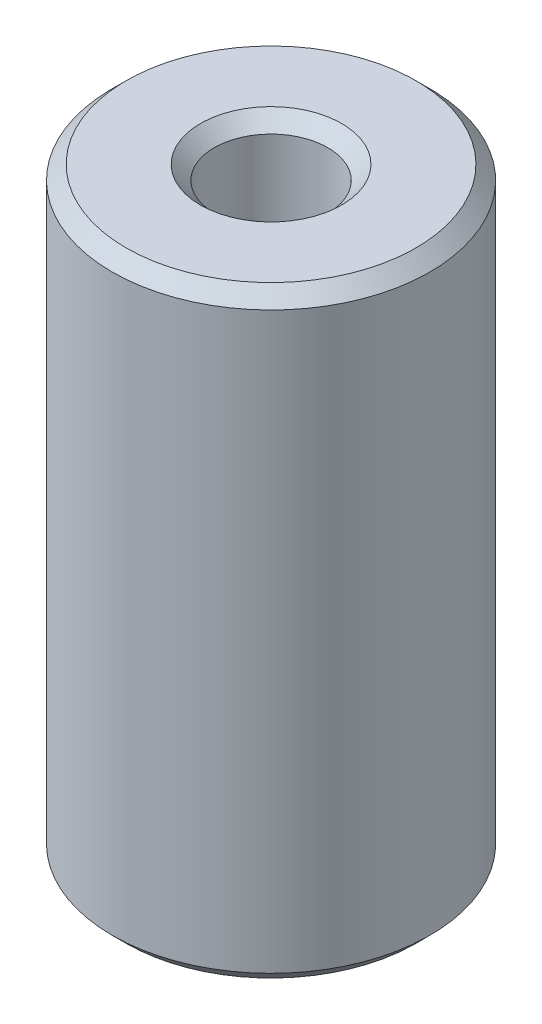
ISO-10303-21;
HEADER;
FILE_DESCRIPTION(('STEP AP214'),'2;1');
FILE_NAME('part.step','',(''),(''),'','','');
FILE_SCHEMA(('AUTOMOTIVE_DESIGN { 1 0 10303 214 1 1 1 1 }'));
ENDSEC;
DATA;
#1=APPLICATION_CONTEXT('core data for automotive mechanical design processes');
#2=APPLICATION_PROTOCOL_DEFINITION('international standard','automotive_design',2000,#1);
#3=PRODUCT_CONTEXT('',#1,'mechanical');
#4=PRODUCT('Part','Part','',(#3));
#5=PRODUCT_RELATED_PRODUCT_CATEGORY('part','',(#4));
#6=PRODUCT_DEFINITION_FORMATION('','',#4);
#7=PRODUCT_DEFINITION_CONTEXT('part definition',#1,'design');
#8=PRODUCT_DEFINITION('design','',#6,#7);
#9=PRODUCT_DEFINITION_SHAPE('','',#8);
#10=(LENGTH_UNIT() NAMED_UNIT(*) SI_UNIT(.MILLI.,.METRE.));
#11=(NAMED_UNIT(*) PLANE_ANGLE_UNIT() SI_UNIT($,.RADIAN.));
#12=(NAMED_UNIT(*) SI_UNIT($,.STERADIAN.) SOLID_ANGLE_UNIT());
#13=UNCERTAINTY_MEASURE_WITH_UNIT(LENGTH_MEASURE(1.E-05),#10,'distance_accuracy_value','');
#14=(GEOMETRIC_REPRESENTATION_CONTEXT(3) GLOBAL_UNCERTAINTY_ASSIGNED_CONTEXT((#13)) GLOBAL_UNIT_ASSIGNED_CONTEXT((#10,
#11,#12)) REPRESENTATION_CONTEXT('',''));
#15=CARTESIAN_POINT('',(0.,0.,0.));
#16=DIRECTION('',(0.,0.,1.));
#17=DIRECTION('',(1.,0.,0.));
#18=AXIS2_PLACEMENT_3D('',#15,#16,#17);
#19=CARTESIAN_POINT('',(0.,28.4437403289238,0.));
#20=DIRECTION('',(0.,-1.,0.));
#21=DIRECTION('',(0.,0.,-1.));
#22=AXIS2_PLACEMENT_3D('',#19,#20,#21);
#23=CYLINDRICAL_SURFACE('',#22,7.5);
#24=CARTESIAN_POINT('',(0.,0.657564701101291,0.));
#25=DIRECTION('',(0.,1.,0.));
#26=DIRECTION('',(0.,0.,1.));
#27=AXIS2_PLACEMENT_3D('',#24,#25,#26);
#28=CIRCLE('',#27,7.5);
#29=CARTESIAN_POINT('',(0.,0.657564701101291,7.5));
#30=VERTEX_POINT('',#29);
#31=EDGE_CURVE('E10',#30,#30,#28,.T.);
#32=ORIENTED_EDGE('',*,*,#31,.T.);
#33=EDGE_LOOP('',(#32));
#34=FACE_BOUND('',#33,.T.);
#35=CARTESIAN_POINT('',(0.,27.7861756278225,0.));
#36=DIRECTION('',(0.,1.,0.));
#37=DIRECTION('',(0.,0.,1.));
#38=AXIS2_PLACEMENT_3D('',#35,#36,#37);
#39=CIRCLE('',#38,7.5);
#40=CARTESIAN_POINT('',(0.,27.7861756278225,7.5));
#41=VERTEX_POINT('',#40);
#42=EDGE_CURVE('E50',#41,#41,#39,.F.);
#43=ORIENTED_EDGE('',*,*,#42,.T.);
#44=EDGE_LOOP('',(#43));
#45=FACE_BOUND('',#44,.T.);
#46=ADVANCED_FACE('F39',(#34,#45),#23,.T.);
#47=CARTESIAN_POINT('',(0.,28.4437403289238,0.));
#48=DIRECTION('',(0.,1.,0.));
#49=DIRECTION('',(0.,0.,1.));
#50=AXIS2_PLACEMENT_3D('',#47,#48,#49);
#51=PLANE('',#50);
#52=CARTESIAN_POINT('',(0.,28.4437403289238,0.));
#53=DIRECTION('',(0.,1.,0.));
#54=DIRECTION('',(0.,0.,1.));
#55=AXIS2_PLACEMENT_3D('',#52,#53,#54);
#56=CIRCLE('',#55,3.33714681555327);
#57=CARTESIAN_POINT('',(0.,28.4437403289238,3.33714681555327));
#58=VERTEX_POINT('',#57);
#59=EDGE_CURVE('E58',#58,#58,#56,.F.);
#60=ORIENTED_EDGE('',*,*,#59,.T.);
#61=EDGE_LOOP('',(#60));
#62=FACE_BOUND('',#61,.T.);
#63=CARTESIAN_POINT('',(0.,28.4437403289238,0.));
#64=DIRECTION('',(0.,1.,0.));
#65=DIRECTION('',(0.,0.,1.));
#66=AXIS2_PLACEMENT_3D('',#63,#64,#65);
#67=CIRCLE('',#66,6.8424352988987);
#68=CARTESIAN_POINT('',(0.,28.4437403289238,6.8424352988987));
#69=VERTEX_POINT('',#68);
#70=EDGE_CURVE('E61',#69,#69,#67,.T.);
#71=ORIENTED_EDGE('',*,*,#70,.T.);
#72=EDGE_LOOP('',(#71));
#73=FACE_BOUND('',#72,.T.);
#74=ADVANCED_FACE('F88',(#62,#73),#51,.T.);
#75=CARTESIAN_POINT('',(0.,0.,0.));
#76=DIRECTION('',(0.,1.,0.));
#77=DIRECTION('',(0.,0.,1.));
#78=AXIS2_PLACEMENT_3D('',#75,#76,#77);
#79=PLANE('',#78);
#80=CARTESIAN_POINT('',(0.,0.,0.));
#81=DIRECTION('',(0.,1.,0.));
#82=DIRECTION('',(0.,0.,1.));
#83=AXIS2_PLACEMENT_3D('',#80,#81,#82);
#84=CIRCLE('',#83,3.33714681555327);
#85=CARTESIAN_POINT('',(0.,0.,3.33714681555327));
#86=VERTEX_POINT('',#85);
#87=EDGE_CURVE('E51',#86,#86,#84,.T.);
#88=ORIENTED_EDGE('',*,*,#87,.T.);
#89=EDGE_LOOP('',(#88));
#90=FACE_BOUND('',#89,.T.);
#91=CARTESIAN_POINT('',(0.,0.,0.));
#92=DIRECTION('',(0.,1.,0.));
#93=DIRECTION('',(0.,0.,1.));
#94=AXIS2_PLACEMENT_3D('',#91,#92,#93);
#95=CIRCLE('',#94,6.8424352988987);
#96=CARTESIAN_POINT('',(0.,0.,6.8424352988987));
#97=VERTEX_POINT('',#96);
#98=EDGE_CURVE('E54',#97,#97,#95,.F.);
#99=ORIENTED_EDGE('',*,*,#98,.T.);
#100=EDGE_LOOP('',(#99));
#101=FACE_BOUND('',#100,.T.);
#102=ADVANCED_FACE('F83',(#90,#101),#79,.F.);
#103=CARTESIAN_POINT('',(0.,28.4437403289238,0.));
#104=DIRECTION('',(0.,-1.,0.));
#105=DIRECTION('',(0.,0.,-1.));
#106=AXIS2_PLACEMENT_3D('',#103,#104,#105);
#107=CYLINDRICAL_SURFACE('',#106,2.67958211445198);
#108=CARTESIAN_POINT('',(0.,27.7861756278225,0.));
#109=DIRECTION('',(0.,1.,0.));
#110=DIRECTION('',(0.,0.,1.));
#111=AXIS2_PLACEMENT_3D('',#108,#109,#110);
#112=CIRCLE('',#111,2.67958211445198);
#113=CARTESIAN_POINT('',(0.,27.7861756278225,2.67958211445198));
#114=VERTEX_POINT('',#113);
#115=EDGE_CURVE('E67',#114,#114,#112,.T.);
#116=ORIENTED_EDGE('',*,*,#115,.T.);
#117=EDGE_LOOP('',(#116));
#118=FACE_BOUND('',#117,.T.);
#119=CARTESIAN_POINT('',(0.,0.657564701101294,0.));
#120=DIRECTION('',(0.,1.,0.));
#121=DIRECTION('',(0.,0.,1.));
#122=AXIS2_PLACEMENT_3D('',#119,#120,#121);
#123=CIRCLE('',#122,2.67958211445198);
#124=CARTESIAN_POINT('',(0.,0.657564701101294,2.67958211445198));
#125=VERTEX_POINT('',#124);
#126=EDGE_CURVE('E69',#125,#125,#123,.F.);
#127=ORIENTED_EDGE('',*,*,#126,.T.);
#128=EDGE_LOOP('',(#127));
#129=FACE_BOUND('',#128,.T.);
#130=ADVANCED_FACE('F71',(#118,#129),#107,.F.);
#131=CARTESIAN_POINT('',(0.,27.7861756278225,0.));
#132=DIRECTION('',(0.,1.,0.));
#133=DIRECTION('',(0.,0.,1.));
#134=AXIS2_PLACEMENT_3D('',#131,#132,#133);
#135=CONICAL_SURFACE('',#134,2.67958211445198,0.785398163397452);
#136=ORIENTED_EDGE('',*,*,#59,.F.);
#137=EDGE_LOOP('',(#136));
#138=FACE_BOUND('',#137,.T.);
#139=ORIENTED_EDGE('',*,*,#115,.F.);
#140=EDGE_LOOP('',(#139));
#141=FACE_BOUND('',#140,.T.);
#142=ADVANCED_FACE('F77',(#138,#141),#135,.F.);
#143=CARTESIAN_POINT('',(0.,0.,0.));
#144=DIRECTION('',(0.,-1.,0.));
#145=DIRECTION('',(0.,0.,-1.));
#146=AXIS2_PLACEMENT_3D('',#143,#144,#145);
#147=CONICAL_SURFACE('',#146,3.33714681555327,0.785398163397444);
#148=ORIENTED_EDGE('',*,*,#126,.F.);
#149=EDGE_LOOP('',(#148));
#150=FACE_BOUND('',#149,.T.);
#151=ORIENTED_EDGE('',*,*,#87,.F.);
#152=EDGE_LOOP('',(#151));
#153=FACE_BOUND('',#152,.T.);
#154=ADVANCED_FACE('F73',(#150,#153),#147,.F.);
#155=CARTESIAN_POINT('',(0.,0.657564701101291,0.));
#156=DIRECTION('',(0.,1.,0.));
#157=DIRECTION('',(0.,0.,1.));
#158=AXIS2_PLACEMENT_3D('',#155,#156,#157);
#159=CONICAL_SURFACE('',#158,7.5,0.785398163397451);
#160=ORIENTED_EDGE('',*,*,#98,.F.);
#161=EDGE_LOOP('',(#160));
#162=FACE_BOUND('',#161,.T.);
#163=ORIENTED_EDGE('',*,*,#31,.F.);
#164=EDGE_LOOP('',(#163));
#165=FACE_BOUND('',#164,.T.);
#166=ADVANCED_FACE('F76',(#162,#165),#159,.T.);
#167=CARTESIAN_POINT('',(0.,28.4437403289238,0.));
#168=DIRECTION('',(0.,-1.,0.));
#169=DIRECTION('',(0.,0.,-1.));
#170=AXIS2_PLACEMENT_3D('',#167,#168,#169);
#171=CONICAL_SURFACE('',#170,6.8424352988987,0.785398163397443);
#172=ORIENTED_EDGE('',*,*,#42,.F.);
#173=EDGE_LOOP('',(#172));
#174=FACE_BOUND('',#173,.T.);
#175=ORIENTED_EDGE('',*,*,#70,.F.);
#176=EDGE_LOOP('',(#175));
#177=FACE_BOUND('',#176,.T.);
#178=ADVANCED_FACE('F45',(#174,#177),#171,.T.);
#179=CLOSED_SHELL('',(#46,#74,#102,#130,#142,#154,#166,#178));
#180=MANIFOLD_SOLID_BREP('B2',#179);
#181=ADVANCED_BREP_SHAPE_REPRESENTATION('',(#18,#180),#14);
#182=SHAPE_DEFINITION_REPRESENTATION(#9,#181);
ENDSEC;
END-ISO-10303-21;
